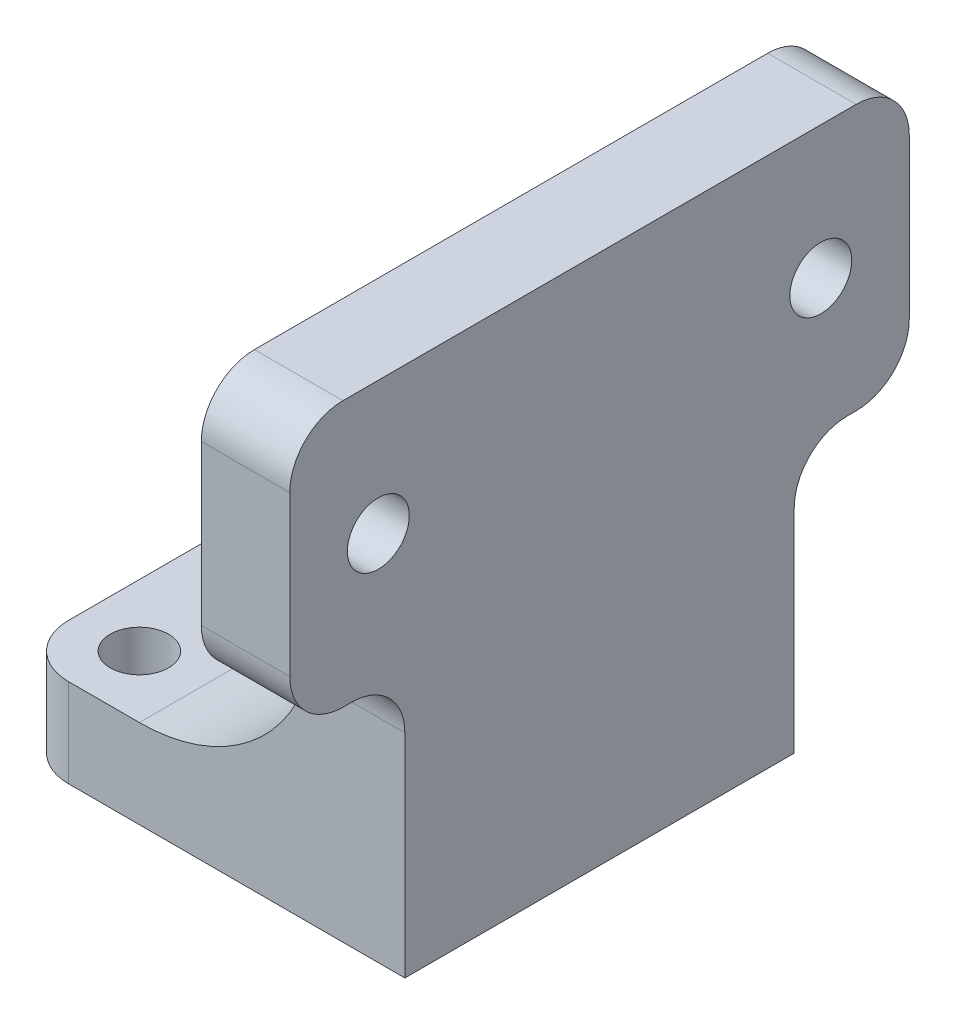
ISO-10303-21;
HEADER;
FILE_DESCRIPTION(('STEP AP214'),'2;1');
FILE_NAME('part.step','',(''),(''),'','','');
FILE_SCHEMA(('AUTOMOTIVE_DESIGN { 1 0 10303 214 1 1 1 1 }'));
ENDSEC;
DATA;
#1=APPLICATION_CONTEXT('core data for automotive mechanical design processes');
#2=APPLICATION_PROTOCOL_DEFINITION('international standard','automotive_design',2000,#1);
#3=PRODUCT_CONTEXT('',#1,'mechanical');
#4=PRODUCT('Part','Part','',(#3));
#5=PRODUCT_RELATED_PRODUCT_CATEGORY('part','',(#4));
#6=PRODUCT_DEFINITION_FORMATION('','',#4);
#7=PRODUCT_DEFINITION_CONTEXT('part definition',#1,'design');
#8=PRODUCT_DEFINITION('design','',#6,#7);
#9=PRODUCT_DEFINITION_SHAPE('','',#8);
#10=(LENGTH_UNIT() NAMED_UNIT(*) SI_UNIT(.MILLI.,.METRE.));
#11=(NAMED_UNIT(*) PLANE_ANGLE_UNIT() SI_UNIT($,.RADIAN.));
#12=(NAMED_UNIT(*) SI_UNIT($,.STERADIAN.) SOLID_ANGLE_UNIT());
#13=UNCERTAINTY_MEASURE_WITH_UNIT(LENGTH_MEASURE(1.E-05),#10,'distance_accuracy_value','');
#14=(GEOMETRIC_REPRESENTATION_CONTEXT(3) GLOBAL_UNCERTAINTY_ASSIGNED_CONTEXT((#13)) GLOBAL_UNIT_ASSIGNED_CONTEXT((#10,
#11,#12)) REPRESENTATION_CONTEXT('',''));
#15=CARTESIAN_POINT('',(0.,0.,0.));
#16=DIRECTION('',(0.,0.,1.));
#17=DIRECTION('',(1.,0.,0.));
#18=AXIS2_PLACEMENT_3D('',#15,#16,#17);
#19=CARTESIAN_POINT('',(0.,5.,0.));
#20=DIRECTION('',(0.,-1.,0.));
#21=DIRECTION('',(0.,0.,-1.));
#22=AXIS2_PLACEMENT_3D('',#19,#20,#21);
#23=PLANE('',#22);
#24=CARTESIAN_POINT('',(3.5,5.,-3.5));
#25=DIRECTION('',(0.,1.,0.));
#26=DIRECTION('',(0.,0.,1.));
#27=AXIS2_PLACEMENT_3D('',#24,#25,#26);
#28=CIRCLE('',#27,1.65);
#29=CARTESIAN_POINT('',(3.5,5.,-1.85));
#30=VERTEX_POINT('',#29);
#31=EDGE_CURVE('E358',#30,#30,#28,.T.);
#32=ORIENTED_EDGE('',*,*,#31,.F.);
#33=EDGE_LOOP('',(#32));
#34=FACE_BOUND('',#33,.T.);
#35=CARTESIAN_POINT('',(3.5,5.,-18.5));
#36=DIRECTION('',(0.,1.,0.));
#37=DIRECTION('',(0.,0.,-1.));
#38=AXIS2_PLACEMENT_3D('',#35,#36,#37);
#39=CIRCLE('',#38,1.65);
#40=CARTESIAN_POINT('',(3.5,5.,-20.15));
#41=VERTEX_POINT('',#40);
#42=EDGE_CURVE('E352',#41,#41,#39,.T.);
#43=ORIENTED_EDGE('',*,*,#42,.F.);
#44=EDGE_LOOP('',(#43));
#45=FACE_BOUND('',#44,.T.);
#46=CARTESIAN_POINT('',(13.5,5.,-11.));
#47=DIRECTION('',(0.,1.,0.));
#48=DIRECTION('',(0.,0.,1.));
#49=AXIS2_PLACEMENT_3D('',#46,#47,#48);
#50=CIRCLE('',#49,1.65);
#51=CARTESIAN_POINT('',(13.5,5.,-9.35));
#52=VERTEX_POINT('',#51);
#53=EDGE_CURVE('E345',#52,#52,#50,.T.);
#54=ORIENTED_EDGE('',*,*,#53,.F.);
#55=EDGE_LOOP('',(#54));
#56=FACE_BOUND('',#55,.T.);
#57=DIRECTION('',(-1.,0.,0.));
#58=VECTOR('',#57,1.);
#59=CARTESIAN_POINT('',(0.,5.,-22.));
#60=LINE('',#59,#58);
#61=CARTESIAN_POINT('',(7.,5.,-22.));
#62=VERTEX_POINT('',#61);
#63=CARTESIAN_POINT('',(3.,5.,-22.));
#64=VERTEX_POINT('',#63);
#65=EDGE_CURVE('E150',#62,#64,#60,.T.);
#66=ORIENTED_EDGE('',*,*,#65,.T.);
#67=CARTESIAN_POINT('',(3.,5.,-19.));
#68=DIRECTION('',(0.,-1.,0.));
#69=DIRECTION('',(0.,0.,-1.));
#70=AXIS2_PLACEMENT_3D('',#67,#68,#69);
#71=CIRCLE('',#70,3.);
#72=CARTESIAN_POINT('',(0.,5.,-19.));
#73=VERTEX_POINT('',#72);
#74=EDGE_CURVE('E167',#64,#73,#71,.F.);
#75=ORIENTED_EDGE('',*,*,#74,.T.);
#76=DIRECTION('',(0.,0.,1.));
#77=VECTOR('',#76,1.);
#78=CARTESIAN_POINT('',(0.,5.,0.));
#79=LINE('',#78,#77);
#80=CARTESIAN_POINT('',(0.,5.,-3.));
#81=VERTEX_POINT('',#80);
#82=EDGE_CURVE('E264',#73,#81,#79,.T.);
#83=ORIENTED_EDGE('',*,*,#82,.T.);
#84=CARTESIAN_POINT('',(3.,5.,-3.));
#85=DIRECTION('',(0.,-1.,0.));
#86=DIRECTION('',(0.,0.,-1.));
#87=AXIS2_PLACEMENT_3D('',#84,#85,#86);
#88=CIRCLE('',#87,3.);
#89=CARTESIAN_POINT('',(3.,5.,0.));
#90=VERTEX_POINT('',#89);
#91=EDGE_CURVE('E160',#81,#90,#88,.F.);
#92=ORIENTED_EDGE('',*,*,#91,.T.);
#93=DIRECTION('',(1.,0.,0.));
#94=VECTOR('',#93,1.);
#95=CARTESIAN_POINT('',(0.,5.,0.));
#96=LINE('',#95,#94);
#97=CARTESIAN_POINT('',(7.00000000000001,5.,0.));
#98=VERTEX_POINT('',#97);
#99=EDGE_CURVE('E273',#90,#98,#96,.T.);
#100=ORIENTED_EDGE('',*,*,#99,.T.);
#101=DIRECTION('',(0.,0.,1.));
#102=VECTOR('',#101,1.);
#103=CARTESIAN_POINT('',(7.00000000000001,5.,-7.5));
#104=LINE('',#103,#102);
#105=CARTESIAN_POINT('',(7.00000000000001,5.,-7.5));
#106=VERTEX_POINT('',#105);
#107=EDGE_CURVE('E328',#98,#106,#104,.F.);
#108=ORIENTED_EDGE('',*,*,#107,.T.);
#109=DIRECTION('',(-1.,0.,0.));
#110=VECTOR('',#109,1.);
#111=CARTESIAN_POINT('',(17.1,5.,-7.5));
#112=LINE('',#111,#110);
#113=CARTESIAN_POINT('',(17.1,5.,-7.5));
#114=VERTEX_POINT('',#113);
#115=EDGE_CURVE('E370',#114,#106,#112,.T.);
#116=ORIENTED_EDGE('',*,*,#115,.F.);
#117=DIRECTION('',(0.,0.,1.));
#118=VECTOR('',#117,1.);
#119=CARTESIAN_POINT('',(17.1,5.,-14.5));
#120=LINE('',#119,#118);
#121=CARTESIAN_POINT('',(17.1,5.,-14.5));
#122=VERTEX_POINT('',#121);
#123=EDGE_CURVE('E385',#122,#114,#120,.T.);
#124=ORIENTED_EDGE('',*,*,#123,.F.);
#125=DIRECTION('',(-1.,0.,0.));
#126=VECTOR('',#125,1.);
#127=CARTESIAN_POINT('',(17.1,5.,-14.5));
#128=LINE('',#127,#126);
#129=CARTESIAN_POINT('',(7.00000000000001,5.,-14.5));
#130=VERTEX_POINT('',#129);
#131=EDGE_CURVE('E367',#122,#130,#128,.T.);
#132=ORIENTED_EDGE('',*,*,#131,.T.);
#133=DIRECTION('',(0.,0.,1.));
#134=VECTOR('',#133,1.);
#135=CARTESIAN_POINT('',(7.,5.,-22.));
#136=LINE('',#135,#134);
#137=EDGE_CURVE('E325',#130,#62,#136,.F.);
#138=ORIENTED_EDGE('',*,*,#137,.T.);
#139=EDGE_LOOP('',(#66,#75,#83,#92,#100,#108,#116,#124,#132,#138));
#140=FACE_BOUND('',#139,.T.);
#141=ADVANCED_FACE('F43',(#34,#45,#56,#140),#23,.F.);
#142=CARTESIAN_POINT('',(0.,0.,0.));
#143=DIRECTION('',(0.,-1.,0.));
#144=DIRECTION('',(0.,0.,-1.));
#145=AXIS2_PLACEMENT_3D('',#142,#143,#144);
#146=PLANE('',#145);
#147=CARTESIAN_POINT('',(3.5,0.,-18.5));
#148=DIRECTION('',(0.,1.,0.));
#149=DIRECTION('',(0.,0.,-1.));
#150=AXIS2_PLACEMENT_3D('',#147,#148,#149);
#151=CIRCLE('',#150,1.65);
#152=CARTESIAN_POINT('',(3.5,0.,-20.15));
#153=VERTEX_POINT('',#152);
#154=EDGE_CURVE('E355',#153,#153,#151,.T.);
#155=ORIENTED_EDGE('',*,*,#154,.T.);
#156=EDGE_LOOP('',(#155));
#157=FACE_BOUND('',#156,.T.);
#158=DIRECTION('',(0.,0.,1.));
#159=VECTOR('',#158,1.);
#160=CARTESIAN_POINT('',(0.,0.,0.));
#161=LINE('',#160,#159);
#162=CARTESIAN_POINT('',(0.,0.,-19.));
#163=VERTEX_POINT('',#162);
#164=CARTESIAN_POINT('',(0.,0.,-3.));
#165=VERTEX_POINT('',#164);
#166=EDGE_CURVE('E343',#163,#165,#161,.T.);
#167=ORIENTED_EDGE('',*,*,#166,.F.);
#168=CARTESIAN_POINT('',(3.,0.,-19.));
#169=DIRECTION('',(0.,-1.,0.));
#170=DIRECTION('',(0.,0.,-1.));
#171=AXIS2_PLACEMENT_3D('',#168,#169,#170);
#172=CIRCLE('',#171,3.);
#173=CARTESIAN_POINT('',(3.,0.,-22.));
#174=VERTEX_POINT('',#173);
#175=EDGE_CURVE('E158',#163,#174,#172,.T.);
#176=ORIENTED_EDGE('',*,*,#175,.T.);
#177=DIRECTION('',(-1.,0.,0.));
#178=VECTOR('',#177,1.);
#179=CARTESIAN_POINT('',(0.,0.,-22.));
#180=LINE('',#179,#178);
#181=CARTESIAN_POINT('',(22.,0.,-22.));
#182=VERTEX_POINT('',#181);
#183=EDGE_CURVE('E274',#182,#174,#180,.T.);
#184=ORIENTED_EDGE('',*,*,#183,.F.);
#185=DIRECTION('',(0.,0.,-1.));
#186=VECTOR('',#185,1.);
#187=CARTESIAN_POINT('',(22.,0.,0.));
#188=LINE('',#187,#186);
#189=CARTESIAN_POINT('',(22.,0.,0.));
#190=VERTEX_POINT('',#189);
#191=EDGE_CURVE('E337',#190,#182,#188,.T.);
#192=ORIENTED_EDGE('',*,*,#191,.F.);
#193=DIRECTION('',(1.,0.,0.));
#194=VECTOR('',#193,1.);
#195=CARTESIAN_POINT('',(0.,0.,0.));
#196=LINE('',#195,#194);
#197=CARTESIAN_POINT('',(3.,0.,0.));
#198=VERTEX_POINT('',#197);
#199=EDGE_CURVE('E340',#198,#190,#196,.T.);
#200=ORIENTED_EDGE('',*,*,#199,.F.);
#201=CARTESIAN_POINT('',(3.,0.,-3.));
#202=DIRECTION('',(0.,-1.,0.));
#203=DIRECTION('',(0.,0.,-1.));
#204=AXIS2_PLACEMENT_3D('',#201,#202,#203);
#205=CIRCLE('',#204,3.);
#206=EDGE_CURVE('E162',#198,#165,#205,.T.);
#207=ORIENTED_EDGE('',*,*,#206,.T.);
#208=EDGE_LOOP('',(#167,#176,#184,#192,#200,#207));
#209=FACE_BOUND('',#208,.T.);
#210=CARTESIAN_POINT('',(13.5,0.,-11.));
#211=DIRECTION('',(0.,1.,0.));
#212=DIRECTION('',(0.,0.,1.));
#213=AXIS2_PLACEMENT_3D('',#210,#211,#212);
#214=CIRCLE('',#213,1.65);
#215=CARTESIAN_POINT('',(13.5,0.,-9.35));
#216=VERTEX_POINT('',#215);
#217=EDGE_CURVE('E349',#216,#216,#214,.T.);
#218=ORIENTED_EDGE('',*,*,#217,.T.);
#219=EDGE_LOOP('',(#218));
#220=FACE_BOUND('',#219,.T.);
#221=CARTESIAN_POINT('',(3.5,0.,-3.5));
#222=DIRECTION('',(0.,1.,0.));
#223=DIRECTION('',(0.,0.,1.));
#224=AXIS2_PLACEMENT_3D('',#221,#222,#223);
#225=CIRCLE('',#224,1.65);
#226=CARTESIAN_POINT('',(3.5,0.,-1.85));
#227=VERTEX_POINT('',#226);
#228=EDGE_CURVE('E361',#227,#227,#225,.T.);
#229=ORIENTED_EDGE('',*,*,#228,.T.);
#230=EDGE_LOOP('',(#229));
#231=FACE_BOUND('',#230,.T.);
#232=ADVANCED_FACE('F233',(#157,#209,#220,#231),#146,.T.);
#233=CARTESIAN_POINT('',(0.,5.,0.));
#234=DIRECTION('',(1.,0.,0.));
#235=DIRECTION('',(0.,0.,-1.));
#236=AXIS2_PLACEMENT_3D('',#233,#234,#235);
#237=PLANE('',#236);
#238=ORIENTED_EDGE('',*,*,#82,.F.);
#239=DIRECTION('',(0.,-1.,0.));
#240=VECTOR('',#239,1.);
#241=CARTESIAN_POINT('',(0.,5.,-19.));
#242=LINE('',#241,#240);
#243=EDGE_CURVE('E267',#73,#163,#242,.T.);
#244=ORIENTED_EDGE('',*,*,#243,.T.);
#245=ORIENTED_EDGE('',*,*,#166,.T.);
#246=DIRECTION('',(0.,-1.,0.));
#247=VECTOR('',#246,1.);
#248=CARTESIAN_POINT('',(0.,5.,-3.));
#249=LINE('',#248,#247);
#250=EDGE_CURVE('E270',#165,#81,#249,.F.);
#251=ORIENTED_EDGE('',*,*,#250,.T.);
#252=EDGE_LOOP('',(#238,#244,#245,#251));
#253=FACE_BOUND('',#252,.T.);
#254=ADVANCED_FACE('F240',(#253),#237,.F.);
#255=CARTESIAN_POINT('',(0.,5.,0.));
#256=DIRECTION('',(0.,0.,-1.));
#257=DIRECTION('',(-1.,0.,0.));
#258=AXIS2_PLACEMENT_3D('',#255,#256,#257);
#259=PLANE('',#258);
#260=ORIENTED_EDGE('',*,*,#99,.F.);
#261=DIRECTION('',(0.,-1.,0.));
#262=VECTOR('',#261,1.);
#263=CARTESIAN_POINT('',(3.,5.,0.));
#264=LINE('',#263,#262);
#265=EDGE_CURVE('E170',#90,#198,#264,.T.);
#266=ORIENTED_EDGE('',*,*,#265,.T.);
#267=ORIENTED_EDGE('',*,*,#199,.T.);
#268=DIRECTION('',(0.,-1.,0.));
#269=VECTOR('',#268,1.);
#270=CARTESIAN_POINT('',(22.,5.,0.));
#271=LINE('',#270,#269);
#272=CARTESIAN_POINT('',(22.,12.,0.));
#273=VERTEX_POINT('',#272);
#274=EDGE_CURVE('E331',#273,#190,#271,.T.);
#275=ORIENTED_EDGE('',*,*,#274,.F.);
#276=DIRECTION('',(1.,0.,0.));
#277=VECTOR('',#276,1.);
#278=CARTESIAN_POINT('',(0.,12.,0.));
#279=LINE('',#278,#277);
#280=CARTESIAN_POINT('',(16.5393920141695,12.,0.));
#281=VERTEX_POINT('',#280);
#282=EDGE_CURVE('E73',#273,#281,#279,.F.);
#283=ORIENTED_EDGE('',*,*,#282,.T.);
#284=CARTESIAN_POINT('',(7.00000000000001,15.,0.));
#285=DIRECTION('',(0.,0.,-1.));
#286=DIRECTION('',(-1.,0.,0.));
#287=AXIS2_PLACEMENT_3D('',#284,#285,#286);
#288=CIRCLE('',#287,10.);
#289=EDGE_CURVE('E151',#281,#98,#288,.T.);
#290=ORIENTED_EDGE('',*,*,#289,.T.);
#291=EDGE_LOOP('',(#260,#266,#267,#275,#283,#290));
#292=FACE_BOUND('',#291,.T.);
#293=ADVANCED_FACE('F254',(#292),#259,.F.);
#294=CARTESIAN_POINT('',(22.,5.,0.));
#295=DIRECTION('',(-1.,0.,0.));
#296=DIRECTION('',(0.,0.,1.));
#297=AXIS2_PLACEMENT_3D('',#294,#295,#296);
#298=PLANE('',#297);
#299=DIRECTION('',(0.,1.,0.));
#300=VECTOR('',#299,1.);
#301=CARTESIAN_POINT('',(22.,15.,-28.5));
#302=LINE('',#301,#300);
#303=CARTESIAN_POINT('',(22.,18.,-28.5));
#304=VERTEX_POINT('',#303);
#305=CARTESIAN_POINT('',(22.,27.,-28.5));
#306=VERTEX_POINT('',#305);
#307=EDGE_CURVE('E396',#304,#306,#302,.T.);
#308=ORIENTED_EDGE('',*,*,#307,.T.);
#309=CARTESIAN_POINT('',(22.,27.,-25.5));
#310=DIRECTION('',(-1.,0.,0.));
#311=DIRECTION('',(0.,0.,1.));
#312=AXIS2_PLACEMENT_3D('',#309,#310,#311);
#313=CIRCLE('',#312,3.);
#314=CARTESIAN_POINT('',(22.,30.,-25.5));
#315=VERTEX_POINT('',#314);
#316=EDGE_CURVE('E301',#306,#315,#313,.F.);
#317=ORIENTED_EDGE('',*,*,#316,.T.);
#318=DIRECTION('',(0.,0.,1.));
#319=VECTOR('',#318,1.);
#320=CARTESIAN_POINT('',(22.,30.,6.5));
#321=LINE('',#320,#319);
#322=CARTESIAN_POINT('',(22.,30.,3.5));
#323=VERTEX_POINT('',#322);
#324=EDGE_CURVE('E392',#315,#323,#321,.T.);
#325=ORIENTED_EDGE('',*,*,#324,.T.);
#326=CARTESIAN_POINT('',(22.,27.,3.5));
#327=DIRECTION('',(-1.,0.,0.));
#328=DIRECTION('',(0.,0.,1.));
#329=AXIS2_PLACEMENT_3D('',#326,#327,#328);
#330=CIRCLE('',#329,3.);
#331=CARTESIAN_POINT('',(22.,27.,6.5));
#332=VERTEX_POINT('',#331);
#333=EDGE_CURVE('E307',#323,#332,#330,.F.);
#334=ORIENTED_EDGE('',*,*,#333,.T.);
#335=DIRECTION('',(0.,-1.,0.));
#336=VECTOR('',#335,1.);
#337=CARTESIAN_POINT('',(22.,15.,6.5));
#338=LINE('',#337,#336);
#339=CARTESIAN_POINT('',(22.,18.,6.5));
#340=VERTEX_POINT('',#339);
#341=EDGE_CURVE('E403',#332,#340,#338,.T.);
#342=ORIENTED_EDGE('',*,*,#341,.T.);
#343=CARTESIAN_POINT('',(22.,18.,3.5));
#344=DIRECTION('',(-1.,0.,0.));
#345=DIRECTION('',(0.,0.,1.));
#346=AXIS2_PLACEMENT_3D('',#343,#344,#345);
#347=CIRCLE('',#346,3.);
#348=CARTESIAN_POINT('',(22.,15.,3.5));
#349=VERTEX_POINT('',#348);
#350=EDGE_CURVE('E310',#340,#349,#347,.F.);
#351=ORIENTED_EDGE('',*,*,#350,.T.);
#352=DIRECTION('',(0.,0.,-1.));
#353=VECTOR('',#352,1.);
#354=CARTESIAN_POINT('',(22.,15.,6.5));
#355=LINE('',#354,#353);
#356=CARTESIAN_POINT('',(22.,15.,3.));
#357=VERTEX_POINT('',#356);
#358=EDGE_CURVE('E399',#349,#357,#355,.T.);
#359=ORIENTED_EDGE('',*,*,#358,.T.);
#360=CARTESIAN_POINT('',(22.,12.,3.));
#361=DIRECTION('',(-1.,0.,0.));
#362=DIRECTION('',(0.,0.,1.));
#363=AXIS2_PLACEMENT_3D('',#360,#361,#362);
#364=CIRCLE('',#363,3.);
#365=EDGE_CURVE('E57',#357,#273,#364,.T.);
#366=ORIENTED_EDGE('',*,*,#365,.T.);
#367=ORIENTED_EDGE('',*,*,#274,.T.);
#368=ORIENTED_EDGE('',*,*,#191,.T.);
#369=DIRECTION('',(0.,-1.,0.));
#370=VECTOR('',#369,1.);
#371=CARTESIAN_POINT('',(22.,5.,-22.));
#372=LINE('',#371,#370);
#373=CARTESIAN_POINT('',(22.,12.,-22.));
#374=VERTEX_POINT('',#373);
#375=EDGE_CURVE('E334',#374,#182,#372,.T.);
#376=ORIENTED_EDGE('',*,*,#375,.F.);
#377=CARTESIAN_POINT('',(22.,12.,-25.));
#378=DIRECTION('',(-1.,0.,0.));
#379=DIRECTION('',(0.,0.,1.));
#380=AXIS2_PLACEMENT_3D('',#377,#378,#379);
#381=CIRCLE('',#380,3.);
#382=CARTESIAN_POINT('',(22.,15.,-25.));
#383=VERTEX_POINT('',#382);
#384=EDGE_CURVE('E137',#374,#383,#381,.T.);
#385=ORIENTED_EDGE('',*,*,#384,.T.);
#386=CARTESIAN_POINT('',(22.,15.,-25.5));
#387=VERTEX_POINT('',#386);
#388=EDGE_CURVE('E402',#383,#387,#355,.T.);
#389=ORIENTED_EDGE('',*,*,#388,.T.);
#390=CARTESIAN_POINT('',(22.,18.,-25.5));
#391=DIRECTION('',(-1.,0.,0.));
#392=DIRECTION('',(0.,0.,1.));
#393=AXIS2_PLACEMENT_3D('',#390,#391,#392);
#394=CIRCLE('',#393,3.);
#395=EDGE_CURVE('E304',#387,#304,#394,.F.);
#396=ORIENTED_EDGE('',*,*,#395,.T.);
#397=EDGE_LOOP('',(#308,#317,#325,#334,#342,#351,#359,#366,#367,#368,#376,#385,#389,#396));
#398=FACE_BOUND('',#397,.T.);
#399=CARTESIAN_POINT('',(22.,22.5,1.5));
#400=DIRECTION('',(1.,0.,0.));
#401=DIRECTION('',(0.,0.,-1.));
#402=AXIS2_PLACEMENT_3D('',#399,#400,#401);
#403=CIRCLE('',#402,1.75);
#404=CARTESIAN_POINT('',(22.,22.5,-0.25));
#405=VERTEX_POINT('',#404);
#406=EDGE_CURVE('E423',#405,#405,#403,.T.);
#407=ORIENTED_EDGE('',*,*,#406,.F.);
#408=EDGE_LOOP('',(#407));
#409=FACE_BOUND('',#408,.T.);
#410=CARTESIAN_POINT('',(22.,22.5,-23.5));
#411=DIRECTION('',(1.,0.,0.));
#412=DIRECTION('',(0.,0.,-1.));
#413=AXIS2_PLACEMENT_3D('',#410,#411,#412);
#414=CIRCLE('',#413,1.75);
#415=CARTESIAN_POINT('',(22.,22.5,-25.25));
#416=VERTEX_POINT('',#415);
#417=EDGE_CURVE('E417',#416,#416,#414,.T.);
#418=ORIENTED_EDGE('',*,*,#417,.F.);
#419=EDGE_LOOP('',(#418));
#420=FACE_BOUND('',#419,.T.);
#421=ADVANCED_FACE('F251',(#398,#409,#420),#298,.F.);
#422=CARTESIAN_POINT('',(0.,5.,-22.));
#423=DIRECTION('',(0.,0.,1.));
#424=DIRECTION('',(1.,0.,0.));
#425=AXIS2_PLACEMENT_3D('',#422,#423,#424);
#426=PLANE('',#425);
#427=ORIENTED_EDGE('',*,*,#183,.T.);
#428=DIRECTION('',(0.,-1.,0.));
#429=VECTOR('',#428,1.);
#430=CARTESIAN_POINT('',(3.,5.,-22.));
#431=LINE('',#430,#429);
#432=EDGE_CURVE('E157',#174,#64,#431,.F.);
#433=ORIENTED_EDGE('',*,*,#432,.T.);
#434=ORIENTED_EDGE('',*,*,#65,.F.);
#435=CARTESIAN_POINT('',(7.,15.,-22.));
#436=DIRECTION('',(0.,0.,1.));
#437=DIRECTION('',(1.,0.,0.));
#438=AXIS2_PLACEMENT_3D('',#435,#436,#437);
#439=CIRCLE('',#438,10.);
#440=CARTESIAN_POINT('',(16.5393920141695,12.,-22.));
#441=VERTEX_POINT('',#440);
#442=EDGE_CURVE('E132',#62,#441,#439,.T.);
#443=ORIENTED_EDGE('',*,*,#442,.T.);
#444=DIRECTION('',(-1.,0.,0.));
#445=VECTOR('',#444,1.);
#446=CARTESIAN_POINT('',(0.,12.,-22.));
#447=LINE('',#446,#445);
#448=EDGE_CURVE('E147',#441,#374,#447,.F.);
#449=ORIENTED_EDGE('',*,*,#448,.T.);
#450=ORIENTED_EDGE('',*,*,#375,.T.);
#451=EDGE_LOOP('',(#427,#433,#434,#443,#449,#450));
#452=FACE_BOUND('',#451,.T.);
#453=ADVANCED_FACE('F144',(#452),#426,.F.);
#454=CARTESIAN_POINT('',(13.5,5.,-11.));
#455=DIRECTION('',(0.,-1.,0.));
#456=DIRECTION('',(0.,0.,-1.));
#457=AXIS2_PLACEMENT_3D('',#454,#455,#456);
#458=CYLINDRICAL_SURFACE('',#457,1.65);
#459=ORIENTED_EDGE('',*,*,#53,.T.);
#460=EDGE_LOOP('',(#459));
#461=FACE_BOUND('',#460,.T.);
#462=ORIENTED_EDGE('',*,*,#217,.F.);
#463=EDGE_LOOP('',(#462));
#464=FACE_BOUND('',#463,.T.);
#465=ADVANCED_FACE('F246',(#461,#464),#458,.F.);
#466=CARTESIAN_POINT('',(3.5,5.,-18.5));
#467=DIRECTION('',(0.,-1.,0.));
#468=DIRECTION('',(0.,0.,-1.));
#469=AXIS2_PLACEMENT_3D('',#466,#467,#468);
#470=CYLINDRICAL_SURFACE('',#469,1.65);
#471=ORIENTED_EDGE('',*,*,#42,.T.);
#472=EDGE_LOOP('',(#471));
#473=FACE_BOUND('',#472,.T.);
#474=ORIENTED_EDGE('',*,*,#154,.F.);
#475=EDGE_LOOP('',(#474));
#476=FACE_BOUND('',#475,.T.);
#477=ADVANCED_FACE('F476',(#473,#476),#470,.F.);
#478=CARTESIAN_POINT('',(3.5,5.,-3.5));
#479=DIRECTION('',(0.,-1.,0.));
#480=DIRECTION('',(0.,0.,-1.));
#481=AXIS2_PLACEMENT_3D('',#478,#479,#480);
#482=CYLINDRICAL_SURFACE('',#481,1.65);
#483=ORIENTED_EDGE('',*,*,#31,.T.);
#484=EDGE_LOOP('',(#483));
#485=FACE_BOUND('',#484,.T.);
#486=ORIENTED_EDGE('',*,*,#228,.F.);
#487=EDGE_LOOP('',(#486));
#488=FACE_BOUND('',#487,.T.);
#489=ADVANCED_FACE('F473',(#485,#488),#482,.F.);
#490=CARTESIAN_POINT('',(17.1,15.,-14.5));
#491=DIRECTION('',(0.,0.,-1.));
#492=DIRECTION('',(0.,1.,0.));
#493=AXIS2_PLACEMENT_3D('',#490,#491,#492);
#494=PLANE('',#493);
#495=DIRECTION('',(-1.,0.,0.));
#496=VECTOR('',#495,1.);
#497=CARTESIAN_POINT('',(17.1,15.,-14.5));
#498=LINE('',#497,#496);
#499=CARTESIAN_POINT('',(17.1,15.,-14.5));
#500=VERTEX_POINT('',#499);
#501=CARTESIAN_POINT('',(17.,15.,-14.5));
#502=VERTEX_POINT('',#501);
#503=EDGE_CURVE('E377',#500,#502,#498,.T.);
#504=ORIENTED_EDGE('',*,*,#503,.T.);
#505=CARTESIAN_POINT('',(7.00000000000001,15.,-14.5));
#506=DIRECTION('',(0.,0.,-1.));
#507=DIRECTION('',(0.,1.,0.));
#508=AXIS2_PLACEMENT_3D('',#505,#506,#507);
#509=CIRCLE('',#508,10.);
#510=EDGE_CURVE('E152',#502,#130,#509,.T.);
#511=ORIENTED_EDGE('',*,*,#510,.T.);
#512=ORIENTED_EDGE('',*,*,#131,.F.);
#513=DIRECTION('',(0.,-1.,0.));
#514=VECTOR('',#513,1.);
#515=CARTESIAN_POINT('',(17.1,15.,-14.5));
#516=LINE('',#515,#514);
#517=EDGE_CURVE('E388',#500,#122,#516,.T.);
#518=ORIENTED_EDGE('',*,*,#517,.F.);
#519=EDGE_LOOP('',(#504,#511,#512,#518));
#520=FACE_BOUND('',#519,.T.);
#521=ADVANCED_FACE('F469',(#520),#494,.F.);
#522=CARTESIAN_POINT('',(17.1,15.,-7.5));
#523=DIRECTION('',(0.,0.,1.));
#524=DIRECTION('',(1.,0.,0.));
#525=AXIS2_PLACEMENT_3D('',#522,#523,#524);
#526=PLANE('',#525);
#527=ORIENTED_EDGE('',*,*,#115,.T.);
#528=CARTESIAN_POINT('',(7.00000000000001,15.,-7.5));
#529=DIRECTION('',(0.,0.,1.));
#530=DIRECTION('',(1.,0.,0.));
#531=AXIS2_PLACEMENT_3D('',#528,#529,#530);
#532=CIRCLE('',#531,10.);
#533=CARTESIAN_POINT('',(17.,15.,-7.5));
#534=VERTEX_POINT('',#533);
#535=EDGE_CURVE('E319',#106,#534,#532,.T.);
#536=ORIENTED_EDGE('',*,*,#535,.T.);
#537=DIRECTION('',(-1.,0.,0.));
#538=VECTOR('',#537,1.);
#539=CARTESIAN_POINT('',(17.1,15.,-7.5));
#540=LINE('',#539,#538);
#541=CARTESIAN_POINT('',(17.1,15.,-7.5));
#542=VERTEX_POINT('',#541);
#543=EDGE_CURVE('E374',#542,#534,#540,.T.);
#544=ORIENTED_EDGE('',*,*,#543,.F.);
#545=DIRECTION('',(0.,1.,0.));
#546=VECTOR('',#545,1.);
#547=CARTESIAN_POINT('',(17.1,15.,-7.5));
#548=LINE('',#547,#546);
#549=EDGE_CURVE('E382',#114,#542,#548,.T.);
#550=ORIENTED_EDGE('',*,*,#549,.F.);
#551=EDGE_LOOP('',(#527,#536,#544,#550));
#552=FACE_BOUND('',#551,.T.);
#553=ADVANCED_FACE('F465',(#552),#526,.F.);
#554=CARTESIAN_POINT('',(17.1,0.,0.));
#555=DIRECTION('',(-1.,0.,0.));
#556=DIRECTION('',(0.,0.,1.));
#557=AXIS2_PLACEMENT_3D('',#554,#555,#556);
#558=PLANE('',#557);
#559=ORIENTED_EDGE('',*,*,#517,.T.);
#560=ORIENTED_EDGE('',*,*,#123,.T.);
#561=ORIENTED_EDGE('',*,*,#549,.T.);
#562=DIRECTION('',(0.,0.,-1.));
#563=VECTOR('',#562,1.);
#564=CARTESIAN_POINT('',(17.1,15.,-14.5));
#565=LINE('',#564,#563);
#566=EDGE_CURVE('E371',#542,#500,#565,.T.);
#567=ORIENTED_EDGE('',*,*,#566,.T.);
#568=EDGE_LOOP('',(#559,#560,#561,#567));
#569=FACE_BOUND('',#568,.T.);
#570=ADVANCED_FACE('F230',(#569),#558,.T.);
#571=CARTESIAN_POINT('',(7.,15.,-22.));
#572=DIRECTION('',(0.,0.,-1.));
#573=DIRECTION('',(-1.,0.,0.));
#574=AXIS2_PLACEMENT_3D('',#571,#572,#573);
#575=CYLINDRICAL_SURFACE('',#574,10.);
#576=ORIENTED_EDGE('',*,*,#442,.F.);
#577=ORIENTED_EDGE('',*,*,#137,.F.);
#578=ORIENTED_EDGE('',*,*,#510,.F.);
#579=DIRECTION('',(0.,0.,1.));
#580=VECTOR('',#579,1.);
#581=CARTESIAN_POINT('',(17.,15.,-22.));
#582=LINE('',#581,#580);
#583=CARTESIAN_POINT('',(17.,15.,-25.));
#584=VERTEX_POINT('',#583);
#585=EDGE_CURVE('E87',#584,#502,#582,.T.);
#586=ORIENTED_EDGE('',*,*,#585,.F.);
#587=CARTESIAN_POINT('',(17.,15.,-25.));
#588=CARTESIAN_POINT('',(16.9999920730505,15.0000080474252,-24.915695332883));
#589=CARTESIAN_POINT('',(16.9999997934265,14.9964463867688,-24.8313945026641));
#590=CARTESIAN_POINT('',(16.9999888564433,14.9822459428319,-24.6633946215108));
#591=CARTESIAN_POINT('',(16.9999702002494,14.9716074722235,-24.5796955441545));
#592=CARTESIAN_POINT('',(16.9998488834943,14.9433241459584,-24.4135353884343));
#593=CARTESIAN_POINT('',(16.999746273145,14.9256834814681,-24.3310736000764));
#594=CARTESIAN_POINT('',(16.9993438037903,14.8835389071938,-24.1679483058731));
#595=CARTESIAN_POINT('',(16.9990439472066,14.8590350816735,-24.0872847779624));
#596=CARTESIAN_POINT('',(16.9976359962069,14.7754239410328,-23.8487615065012));
#597=CARTESIAN_POINT('',(16.9960196676673,14.7062068214481,-23.6943098169296));
#598=CARTESIAN_POINT('',(16.9898797017482,14.5429094251339,-23.3993559596941));
#599=CARTESIAN_POINT('',(16.9853565438627,14.4488332505179,-23.2588514957881));
#600=CARTESIAN_POINT('',(16.971550168125,14.2389644528753,-22.9962114899694));
#601=CARTESIAN_POINT('',(16.9622848575556,14.1232545588464,-22.8740090640972));
#602=CARTESIAN_POINT('',(16.9371347621394,13.8734734138726,-22.6509305436526));
#603=CARTESIAN_POINT('',(16.9212511305991,13.7394053647454,-22.5500507380215));
#604=CARTESIAN_POINT('',(16.8816128125326,13.4594189727541,-22.3737765761097));
#605=CARTESIAN_POINT('',(16.8579824298941,13.3137136260604,-22.2980154825242));
#606=CARTESIAN_POINT('',(16.8018622370368,13.0133437293246,-22.1716315392191));
#607=CARTESIAN_POINT('',(16.7693722434008,12.858678993852,-22.1210092099988));
#608=CARTESIAN_POINT('',(16.7049699242345,12.5859151138216,-22.0553438553204));
#609=CARTESIAN_POINT('',(16.6750764114273,12.4686910138774,-22.0344879704897));
#610=CARTESIAN_POINT('',(16.6106528740843,12.2340790228927,-22.0068113184387));
#611=CARTESIAN_POINT('',(16.5761311017525,12.1166917831583,-21.9999659159425));
#612=CARTESIAN_POINT('',(16.5393920141695,12.,-22.));
#613=B_SPLINE_CURVE_WITH_KNOTS('',3,(#587,#588,#589,#590,#591,#592,#593,#594,#595,#596,#597,
#598,#599,#600,#601,#602,#603,#604,#605,#606,#607,#608,#609,#610,#611,#612),.UNSPECIFIED.,.F.,
.F.,(4,2,2,2,2,2,2,2,2,2,2,2,4),(0.,0.252831865688316,0.505652561346429,0.758322158702964,
1.01098865400483,1.51614355640544,2.02121515273819,2.52439342055278,3.02748404133101,
3.52286783153688,4.0182618782597,4.38568561449546,4.7524627356922),.UNSPECIFIED.);
#614=EDGE_CURVE('E127',#584,#441,#613,.T.);
#615=ORIENTED_EDGE('',*,*,#614,.T.);
#616=EDGE_LOOP('',(#576,#577,#578,#586,#615));
#617=FACE_BOUND('',#616,.T.);
#618=ADVANCED_FACE('F129',(#617),#575,.F.);
#619=CARTESIAN_POINT('',(7.,15.,-22.));
#620=DIRECTION('',(0.,0.,-1.));
#621=DIRECTION('',(-1.,0.,0.));
#622=AXIS2_PLACEMENT_3D('',#619,#620,#621);
#623=CYLINDRICAL_SURFACE('',#622,10.);
#624=ORIENTED_EDGE('',*,*,#535,.F.);
#625=ORIENTED_EDGE('',*,*,#107,.F.);
#626=ORIENTED_EDGE('',*,*,#289,.F.);
#627=CARTESIAN_POINT('',(16.5393920141695,12.,0.));
#628=CARTESIAN_POINT('',(16.5646080914241,12.0801508392346,-8.53709798183859E-06));
#629=CARTESIAN_POINT('',(16.5887985701893,12.16063228141,0.00321236347770823));
#630=CARTESIAN_POINT('',(16.6350246792201,12.3217033890142,0.0162063690083739));
#631=CARTESIAN_POINT('',(16.6570598168035,12.4022930749382,0.0259809680595155));
#632=CARTESIAN_POINT('',(16.6988585244118,12.5629849697561,0.0521748684498644));
#633=CARTESIAN_POINT('',(16.7186222537435,12.6430872124636,0.0685937034253539));
#634=CARTESIAN_POINT('',(16.7558274239909,12.8021559612666,0.108067720925997));
#635=CARTESIAN_POINT('',(16.7732690968214,12.8811225800785,0.131122239985568));
#636=CARTESIAN_POINT('',(16.8221581712132,13.1156903600768,0.210300626896062));
#637=CARTESIAN_POINT('',(16.8501276148399,13.268795795836,0.27641303450066));
#638=CARTESIAN_POINT('',(16.8973000201799,13.5627500556097,0.433752558779445));
#639=CARTESIAN_POINT('',(16.9165086333163,13.7036067334302,0.524963423911902));
#640=CARTESIAN_POINT('',(16.9472124921041,13.965601261763,0.727729172000176));
#641=CARTESIAN_POINT('',(16.958873578765,14.0871154039993,0.838772933771466));
#642=CARTESIAN_POINT('',(16.9768367625976,14.310557157785,1.07950242491419));
#643=CARTESIAN_POINT('',(16.983136895817,14.4124775807205,1.20919496582908));
#644=CARTESIAN_POINT('',(16.9921987538657,14.5945637636318,1.48481966187647));
#645=CARTESIAN_POINT('',(16.9949282218961,14.6745261167531,1.63088709064723));
#646=CARTESIAN_POINT('',(16.9984073270546,14.8092049455948,1.9342220188471));
#647=CARTESIAN_POINT('',(16.999157692636,14.8639307040919,2.09148537546719));
#648=CARTESIAN_POINT('',(16.9998506718984,14.9367119283152,2.37419962146824));
#649=CARTESIAN_POINT('',(16.9999439057985,14.9604156148073,2.49822900472787));
#650=CARTESIAN_POINT('',(16.9999996595198,14.9920684324163,2.74815730783535));
#651=CARTESIAN_POINT('',(16.9999623075452,15.00003300358,2.87405427327914));
#652=CARTESIAN_POINT('',(17.,15.,3.));
#653=B_SPLINE_CURVE_WITH_KNOTS('',3,(#627,#628,#629,#630,#631,#632,#633,#634,#635,#636,#637,
#638,#639,#640,#641,#642,#643,#644,#645,#646,#647,#648,#649,#650,#651,#652),.UNSPECIFIED.,.F.,
.F.,(4,2,2,2,2,2,2,2,2,2,2,2,4),(0.,0.252012827109156,0.504083127030998,0.756135737024466,
1.00816315441195,1.51272431595965,2.01695953400225,2.50970101819745,3.0026229375851,
3.49996776526982,3.99712950839466,4.37499373589962,4.75248709482411),.UNSPECIFIED.);
#654=CARTESIAN_POINT('',(17.,15.,3.));
#655=VERTEX_POINT('',#654);
#656=EDGE_CURVE('E11',#281,#655,#653,.T.);
#657=ORIENTED_EDGE('',*,*,#656,.T.);
#658=EDGE_CURVE('E64',#534,#655,#582,.T.);
#659=ORIENTED_EDGE('',*,*,#658,.F.);
#660=EDGE_LOOP('',(#624,#625,#626,#657,#659));
#661=FACE_BOUND('',#660,.T.);
#662=ADVANCED_FACE('F216',(#661),#623,.F.);
#663=CARTESIAN_POINT('',(17.,15.,6.5));
#664=DIRECTION('',(0.,-1.,0.));
#665=DIRECTION('',(0.,0.,-1.));
#666=AXIS2_PLACEMENT_3D('',#663,#664,#665);
#667=PLANE('',#666);
#668=ORIENTED_EDGE('',*,*,#503,.F.);
#669=ORIENTED_EDGE('',*,*,#566,.F.);
#670=ORIENTED_EDGE('',*,*,#543,.T.);
#671=DIRECTION('',(0.,0.,-1.));
#672=VECTOR('',#671,1.);
#673=CARTESIAN_POINT('',(17.,15.,6.5));
#674=LINE('',#673,#672);
#675=EDGE_CURVE('E414',#534,#502,#674,.T.);
#676=ORIENTED_EDGE('',*,*,#675,.T.);
#677=EDGE_LOOP('',(#668,#669,#670,#676));
#678=FACE_BOUND('',#677,.T.);
#679=ADVANCED_FACE('F219',(#678),#667,.T.);
#680=ORIENTED_EDGE('',*,*,#358,.F.);
#681=DIRECTION('',(1.,0.,0.));
#682=VECTOR('',#681,1.);
#683=CARTESIAN_POINT('',(17.,15.,3.5));
#684=LINE('',#683,#682);
#685=CARTESIAN_POINT('',(17.,15.,3.5));
#686=VERTEX_POINT('',#685);
#687=EDGE_CURVE('E138',#349,#686,#684,.F.);
#688=ORIENTED_EDGE('',*,*,#687,.T.);
#689=EDGE_CURVE('E412',#686,#655,#674,.T.);
#690=ORIENTED_EDGE('',*,*,#689,.T.);
#691=DIRECTION('',(1.,0.,0.));
#692=VECTOR('',#691,1.);
#693=CARTESIAN_POINT('',(17.,15.,3.));
#694=LINE('',#693,#692);
#695=EDGE_CURVE('E178',#655,#357,#694,.T.);
#696=ORIENTED_EDGE('',*,*,#695,.T.);
#697=EDGE_LOOP('',(#680,#688,#690,#696));
#698=FACE_BOUND('',#697,.T.);
#699=ADVANCED_FACE('F226',(#698),#667,.T.);
#700=CARTESIAN_POINT('',(17.,15.,6.5));
#701=DIRECTION('',(0.,0.,1.));
#702=DIRECTION('',(0.,-1.,0.));
#703=AXIS2_PLACEMENT_3D('',#700,#701,#702);
#704=PLANE('',#703);
#705=ORIENTED_EDGE('',*,*,#341,.F.);
#706=DIRECTION('',(1.,0.,0.));
#707=VECTOR('',#706,1.);
#708=CARTESIAN_POINT('',(17.,27.,6.5));
#709=LINE('',#708,#707);
#710=CARTESIAN_POINT('',(17.,27.,6.5));
#711=VERTEX_POINT('',#710);
#712=EDGE_CURVE('E176',#332,#711,#709,.F.);
#713=ORIENTED_EDGE('',*,*,#712,.T.);
#714=DIRECTION('',(0.,-1.,0.));
#715=VECTOR('',#714,1.);
#716=CARTESIAN_POINT('',(17.,15.,6.5));
#717=LINE('',#716,#715);
#718=CARTESIAN_POINT('',(17.,18.,6.5));
#719=VERTEX_POINT('',#718);
#720=EDGE_CURVE('E395',#711,#719,#717,.T.);
#721=ORIENTED_EDGE('',*,*,#720,.T.);
#722=DIRECTION('',(1.,0.,0.));
#723=VECTOR('',#722,1.);
#724=CARTESIAN_POINT('',(17.,18.,6.5));
#725=LINE('',#724,#723);
#726=EDGE_CURVE('E173',#719,#340,#725,.T.);
#727=ORIENTED_EDGE('',*,*,#726,.T.);
#728=EDGE_LOOP('',(#705,#713,#721,#727));
#729=FACE_BOUND('',#728,.T.);
#730=ADVANCED_FACE('F453',(#729),#704,.T.);
#731=CARTESIAN_POINT('',(17.,30.,6.5));
#732=DIRECTION('',(0.,1.,0.));
#733=DIRECTION('',(0.,0.,1.));
#734=AXIS2_PLACEMENT_3D('',#731,#732,#733);
#735=PLANE('',#734);
#736=ORIENTED_EDGE('',*,*,#324,.F.);
#737=DIRECTION('',(1.,0.,0.));
#738=VECTOR('',#737,1.);
#739=CARTESIAN_POINT('',(17.,30.,-25.5));
#740=LINE('',#739,#738);
#741=CARTESIAN_POINT('',(17.,30.,-25.5));
#742=VERTEX_POINT('',#741);
#743=EDGE_CURVE('E295',#315,#742,#740,.F.);
#744=ORIENTED_EDGE('',*,*,#743,.T.);
#745=DIRECTION('',(0.,0.,1.));
#746=VECTOR('',#745,1.);
#747=CARTESIAN_POINT('',(17.,30.,6.5));
#748=LINE('',#747,#746);
#749=CARTESIAN_POINT('',(17.,30.,3.5));
#750=VERTEX_POINT('',#749);
#751=EDGE_CURVE('E391',#742,#750,#748,.T.);
#752=ORIENTED_EDGE('',*,*,#751,.T.);
#753=DIRECTION('',(1.,0.,0.));
#754=VECTOR('',#753,1.);
#755=CARTESIAN_POINT('',(17.,30.,3.5));
#756=LINE('',#755,#754);
#757=EDGE_CURVE('E298',#750,#323,#756,.T.);
#758=ORIENTED_EDGE('',*,*,#757,.T.);
#759=EDGE_LOOP('',(#736,#744,#752,#758));
#760=FACE_BOUND('',#759,.T.);
#761=ADVANCED_FACE('F449',(#760),#735,.T.);
#762=CARTESIAN_POINT('',(17.,15.,-28.5));
#763=DIRECTION('',(0.,0.,-1.));
#764=DIRECTION('',(0.,1.,0.));
#765=AXIS2_PLACEMENT_3D('',#762,#763,#764);
#766=PLANE('',#765);
#767=DIRECTION('',(0.,1.,0.));
#768=VECTOR('',#767,1.);
#769=CARTESIAN_POINT('',(17.,15.,-28.5));
#770=LINE('',#769,#768);
#771=CARTESIAN_POINT('',(17.,18.,-28.5));
#772=VERTEX_POINT('',#771);
#773=CARTESIAN_POINT('',(17.,27.,-28.5));
#774=VERTEX_POINT('',#773);
#775=EDGE_CURVE('E409',#772,#774,#770,.T.);
#776=ORIENTED_EDGE('',*,*,#775,.T.);
#777=DIRECTION('',(1.,0.,0.));
#778=VECTOR('',#777,1.);
#779=CARTESIAN_POINT('',(17.,27.,-28.5));
#780=LINE('',#779,#778);
#781=EDGE_CURVE('E313',#774,#306,#780,.T.);
#782=ORIENTED_EDGE('',*,*,#781,.T.);
#783=ORIENTED_EDGE('',*,*,#307,.F.);
#784=DIRECTION('',(1.,0.,0.));
#785=VECTOR('',#784,1.);
#786=CARTESIAN_POINT('',(17.,18.,-28.5));
#787=LINE('',#786,#785);
#788=EDGE_CURVE('E316',#304,#772,#787,.F.);
#789=ORIENTED_EDGE('',*,*,#788,.T.);
#790=EDGE_LOOP('',(#776,#782,#783,#789));
#791=FACE_BOUND('',#790,.T.);
#792=ADVANCED_FACE('F452',(#791),#766,.T.);
#793=CARTESIAN_POINT('',(17.,15.,-25.5));
#794=VERTEX_POINT('',#793);
#795=EDGE_CURVE('E415',#584,#794,#674,.T.);
#796=ORIENTED_EDGE('',*,*,#795,.T.);
#797=DIRECTION('',(1.,0.,0.));
#798=VECTOR('',#797,1.);
#799=CARTESIAN_POINT('',(17.,15.,-25.5));
#800=LINE('',#799,#798);
#801=EDGE_CURVE('E279',#794,#387,#800,.T.);
#802=ORIENTED_EDGE('',*,*,#801,.T.);
#803=ORIENTED_EDGE('',*,*,#388,.F.);
#804=DIRECTION('',(-1.,0.,0.));
#805=VECTOR('',#804,1.);
#806=CARTESIAN_POINT('',(17.,15.,-25.));
#807=LINE('',#806,#805);
#808=EDGE_CURVE('E284',#383,#584,#807,.T.);
#809=ORIENTED_EDGE('',*,*,#808,.T.);
#810=EDGE_LOOP('',(#796,#802,#803,#809));
#811=FACE_BOUND('',#810,.T.);
#812=ADVANCED_FACE('F229',(#811),#667,.T.);
#813=CARTESIAN_POINT('',(17.,0.,0.));
#814=DIRECTION('',(-1.,0.,0.));
#815=DIRECTION('',(0.,0.,1.));
#816=AXIS2_PLACEMENT_3D('',#813,#814,#815);
#817=PLANE('',#816);
#818=CARTESIAN_POINT('',(17.,22.5,1.5));
#819=DIRECTION('',(1.,0.,0.));
#820=DIRECTION('',(0.,0.,-1.));
#821=AXIS2_PLACEMENT_3D('',#818,#819,#820);
#822=CIRCLE('',#821,1.75);
#823=CARTESIAN_POINT('',(17.,22.5,-0.25));
#824=VERTEX_POINT('',#823);
#825=EDGE_CURVE('E420',#824,#824,#822,.T.);
#826=ORIENTED_EDGE('',*,*,#825,.T.);
#827=EDGE_LOOP('',(#826));
#828=FACE_BOUND('',#827,.T.);
#829=CARTESIAN_POINT('',(17.,22.5,-23.5));
#830=DIRECTION('',(1.,0.,0.));
#831=DIRECTION('',(0.,0.,-1.));
#832=AXIS2_PLACEMENT_3D('',#829,#830,#831);
#833=CIRCLE('',#832,1.75);
#834=CARTESIAN_POINT('',(17.,22.5,-25.25));
#835=VERTEX_POINT('',#834);
#836=EDGE_CURVE('E406',#835,#835,#833,.T.);
#837=ORIENTED_EDGE('',*,*,#836,.T.);
#838=EDGE_LOOP('',(#837));
#839=FACE_BOUND('',#838,.T.);
#840=ORIENTED_EDGE('',*,*,#751,.F.);
#841=CARTESIAN_POINT('',(17.,27.,-25.5));
#842=DIRECTION('',(-1.,0.,0.));
#843=DIRECTION('',(0.,0.,1.));
#844=AXIS2_PLACEMENT_3D('',#841,#842,#843);
#845=CIRCLE('',#844,3.);
#846=EDGE_CURVE('E286',#742,#774,#845,.T.);
#847=ORIENTED_EDGE('',*,*,#846,.T.);
#848=ORIENTED_EDGE('',*,*,#775,.F.);
#849=CARTESIAN_POINT('',(17.,18.,-25.5));
#850=DIRECTION('',(-1.,0.,0.));
#851=DIRECTION('',(0.,0.,1.));
#852=AXIS2_PLACEMENT_3D('',#849,#850,#851);
#853=CIRCLE('',#852,3.);
#854=EDGE_CURVE('E289',#772,#794,#853,.T.);
#855=ORIENTED_EDGE('',*,*,#854,.T.);
#856=ORIENTED_EDGE('',*,*,#795,.F.);
#857=ORIENTED_EDGE('',*,*,#585,.T.);
#858=ORIENTED_EDGE('',*,*,#675,.F.);
#859=ORIENTED_EDGE('',*,*,#658,.T.);
#860=ORIENTED_EDGE('',*,*,#689,.F.);
#861=CARTESIAN_POINT('',(17.,18.,3.5));
#862=DIRECTION('',(-1.,0.,0.));
#863=DIRECTION('',(0.,0.,1.));
#864=AXIS2_PLACEMENT_3D('',#861,#862,#863);
#865=CIRCLE('',#864,3.);
#866=EDGE_CURVE('E97',#686,#719,#865,.T.);
#867=ORIENTED_EDGE('',*,*,#866,.T.);
#868=ORIENTED_EDGE('',*,*,#720,.F.);
#869=CARTESIAN_POINT('',(17.,27.,3.5));
#870=DIRECTION('',(-1.,0.,0.));
#871=DIRECTION('',(0.,0.,1.));
#872=AXIS2_PLACEMENT_3D('',#869,#870,#871);
#873=CIRCLE('',#872,3.);
#874=EDGE_CURVE('E291',#711,#750,#873,.T.);
#875=ORIENTED_EDGE('',*,*,#874,.T.);
#876=EDGE_LOOP('',(#840,#847,#848,#855,#856,#857,#858,#859,#860,#867,#868,#875));
#877=FACE_BOUND('',#876,.T.);
#878=ADVANCED_FACE('F429',(#828,#839,#877),#817,.T.);
#879=CARTESIAN_POINT('',(17.,22.5,-23.5));
#880=DIRECTION('',(1.,0.,0.));
#881=DIRECTION('',(0.,0.,-1.));
#882=AXIS2_PLACEMENT_3D('',#879,#880,#881);
#883=CYLINDRICAL_SURFACE('',#882,1.75);
#884=ORIENTED_EDGE('',*,*,#836,.F.);
#885=EDGE_LOOP('',(#884));
#886=FACE_BOUND('',#885,.T.);
#887=ORIENTED_EDGE('',*,*,#417,.T.);
#888=EDGE_LOOP('',(#887));
#889=FACE_BOUND('',#888,.T.);
#890=ADVANCED_FACE('F433',(#886,#889),#883,.F.);
#891=CARTESIAN_POINT('',(17.,22.5,1.5));
#892=DIRECTION('',(1.,0.,0.));
#893=DIRECTION('',(0.,0.,-1.));
#894=AXIS2_PLACEMENT_3D('',#891,#892,#893);
#895=CYLINDRICAL_SURFACE('',#894,1.75);
#896=ORIENTED_EDGE('',*,*,#825,.F.);
#897=EDGE_LOOP('',(#896));
#898=FACE_BOUND('',#897,.T.);
#899=ORIENTED_EDGE('',*,*,#406,.T.);
#900=EDGE_LOOP('',(#899));
#901=FACE_BOUND('',#900,.T.);
#902=ADVANCED_FACE('F214',(#898,#901),#895,.F.);
#903=CARTESIAN_POINT('',(17.,27.,-25.5));
#904=DIRECTION('',(1.,0.,0.));
#905=DIRECTION('',(0.,0.,-1.));
#906=AXIS2_PLACEMENT_3D('',#903,#904,#905);
#907=CYLINDRICAL_SURFACE('',#906,3.);
#908=ORIENTED_EDGE('',*,*,#846,.F.);
#909=ORIENTED_EDGE('',*,*,#743,.F.);
#910=ORIENTED_EDGE('',*,*,#316,.F.);
#911=ORIENTED_EDGE('',*,*,#781,.F.);
#912=EDGE_LOOP('',(#908,#909,#910,#911));
#913=FACE_BOUND('',#912,.T.);
#914=ADVANCED_FACE('F211',(#913),#907,.T.);
#915=CARTESIAN_POINT('',(17.,18.,-25.5));
#916=DIRECTION('',(1.,0.,0.));
#917=DIRECTION('',(0.,0.,-1.));
#918=AXIS2_PLACEMENT_3D('',#915,#916,#917);
#919=CYLINDRICAL_SURFACE('',#918,3.);
#920=ORIENTED_EDGE('',*,*,#854,.F.);
#921=ORIENTED_EDGE('',*,*,#788,.F.);
#922=ORIENTED_EDGE('',*,*,#395,.F.);
#923=ORIENTED_EDGE('',*,*,#801,.F.);
#924=EDGE_LOOP('',(#920,#921,#922,#923));
#925=FACE_BOUND('',#924,.T.);
#926=ADVANCED_FACE('F207',(#925),#919,.T.);
#927=CARTESIAN_POINT('',(3.,5.,-19.));
#928=DIRECTION('',(0.,-1.,0.));
#929=DIRECTION('',(0.,0.,-1.));
#930=AXIS2_PLACEMENT_3D('',#927,#928,#929);
#931=CYLINDRICAL_SURFACE('',#930,3.);
#932=ORIENTED_EDGE('',*,*,#74,.F.);
#933=ORIENTED_EDGE('',*,*,#432,.F.);
#934=ORIENTED_EDGE('',*,*,#175,.F.);
#935=ORIENTED_EDGE('',*,*,#243,.F.);
#936=EDGE_LOOP('',(#932,#933,#934,#935));
#937=FACE_BOUND('',#936,.T.);
#938=ADVANCED_FACE('F203',(#937),#931,.T.);
#939=CARTESIAN_POINT('',(3.,5.,-3.));
#940=DIRECTION('',(0.,-1.,0.));
#941=DIRECTION('',(0.,0.,-1.));
#942=AXIS2_PLACEMENT_3D('',#939,#940,#941);
#943=CYLINDRICAL_SURFACE('',#942,3.);
#944=ORIENTED_EDGE('',*,*,#91,.F.);
#945=ORIENTED_EDGE('',*,*,#250,.F.);
#946=ORIENTED_EDGE('',*,*,#206,.F.);
#947=ORIENTED_EDGE('',*,*,#265,.F.);
#948=EDGE_LOOP('',(#944,#945,#946,#947));
#949=FACE_BOUND('',#948,.T.);
#950=ADVANCED_FACE('F199',(#949),#943,.T.);
#951=CARTESIAN_POINT('',(17.,27.,3.5));
#952=DIRECTION('',(1.,0.,0.));
#953=DIRECTION('',(0.,0.,-1.));
#954=AXIS2_PLACEMENT_3D('',#951,#952,#953);
#955=CYLINDRICAL_SURFACE('',#954,3.);
#956=ORIENTED_EDGE('',*,*,#874,.F.);
#957=ORIENTED_EDGE('',*,*,#712,.F.);
#958=ORIENTED_EDGE('',*,*,#333,.F.);
#959=ORIENTED_EDGE('',*,*,#757,.F.);
#960=EDGE_LOOP('',(#956,#957,#958,#959));
#961=FACE_BOUND('',#960,.T.);
#962=ADVANCED_FACE('F195',(#961),#955,.T.);
#963=CARTESIAN_POINT('',(17.,18.,3.5));
#964=DIRECTION('',(1.,0.,0.));
#965=DIRECTION('',(0.,0.,-1.));
#966=AXIS2_PLACEMENT_3D('',#963,#964,#965);
#967=CYLINDRICAL_SURFACE('',#966,3.);
#968=ORIENTED_EDGE('',*,*,#866,.F.);
#969=ORIENTED_EDGE('',*,*,#687,.F.);
#970=ORIENTED_EDGE('',*,*,#350,.F.);
#971=ORIENTED_EDGE('',*,*,#726,.F.);
#972=EDGE_LOOP('',(#968,#969,#970,#971));
#973=FACE_BOUND('',#972,.T.);
#974=ADVANCED_FACE('F192',(#973),#967,.T.);
#975=CARTESIAN_POINT('',(17.,12.,-25.));
#976=DIRECTION('',(-1.,0.,0.));
#977=DIRECTION('',(0.,0.,1.));
#978=AXIS2_PLACEMENT_3D('',#975,#976,#977);
#979=CYLINDRICAL_SURFACE('',#978,3.);
#980=ORIENTED_EDGE('',*,*,#384,.F.);
#981=ORIENTED_EDGE('',*,*,#448,.F.);
#982=ORIENTED_EDGE('',*,*,#614,.F.);
#983=ORIENTED_EDGE('',*,*,#808,.F.);
#984=EDGE_LOOP('',(#980,#981,#982,#983));
#985=FACE_BOUND('',#984,.T.);
#986=ADVANCED_FACE('F155',(#985),#979,.F.);
#987=CARTESIAN_POINT('',(17.,12.,3.));
#988=DIRECTION('',(1.,0.,0.));
#989=DIRECTION('',(0.,0.,-1.));
#990=AXIS2_PLACEMENT_3D('',#987,#988,#989);
#991=CYLINDRICAL_SURFACE('',#990,3.);
#992=ORIENTED_EDGE('',*,*,#656,.F.);
#993=ORIENTED_EDGE('',*,*,#282,.F.);
#994=ORIENTED_EDGE('',*,*,#365,.F.);
#995=ORIENTED_EDGE('',*,*,#695,.F.);
#996=EDGE_LOOP('',(#992,#993,#994,#995));
#997=FACE_BOUND('',#996,.T.);
#998=ADVANCED_FACE('F45',(#997),#991,.F.);
#999=CLOSED_SHELL('',(#141,#232,#254,#293,#421,#453,#465,#477,#489,#521,#553,#570,#618,#662,
#679,#699,#730,#761,#792,#812,#878,#890,#902,#914,#926,#938,#950,#962,#974,#986,#998));
#1000=MANIFOLD_SOLID_BREP('B2',#999);
#1001=ADVANCED_BREP_SHAPE_REPRESENTATION('',(#18,#1000),#14);
#1002=SHAPE_DEFINITION_REPRESENTATION(#9,#1001);
ENDSEC;
END-ISO-10303-21;
